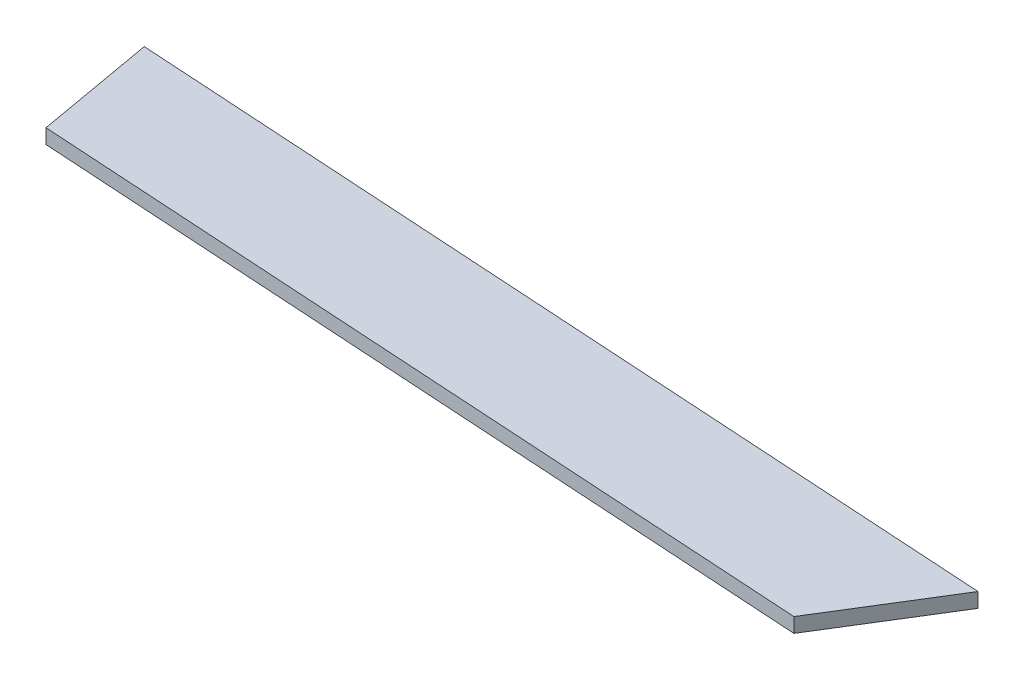
ISO-10303-21;
HEADER;
FILE_DESCRIPTION(('STEP AP214'),'2;1');
FILE_NAME('part.step','',(''),(''),'','','');
FILE_SCHEMA(('AUTOMOTIVE_DESIGN { 1 0 10303 214 1 1 1 1 }'));
ENDSEC;
DATA;
#1=APPLICATION_CONTEXT('core data for automotive mechanical design processes');
#2=APPLICATION_PROTOCOL_DEFINITION('international standard','automotive_design',2000,#1);
#3=PRODUCT_CONTEXT('',#1,'mechanical');
#4=PRODUCT('Part','Part','',(#3));
#5=PRODUCT_RELATED_PRODUCT_CATEGORY('part','',(#4));
#6=PRODUCT_DEFINITION_FORMATION('','',#4);
#7=PRODUCT_DEFINITION_CONTEXT('part definition',#1,'design');
#8=PRODUCT_DEFINITION('design','',#6,#7);
#9=PRODUCT_DEFINITION_SHAPE('','',#8);
#10=(LENGTH_UNIT() NAMED_UNIT(*) SI_UNIT(.MILLI.,.METRE.));
#11=(NAMED_UNIT(*) PLANE_ANGLE_UNIT() SI_UNIT($,.RADIAN.));
#12=(NAMED_UNIT(*) SI_UNIT($,.STERADIAN.) SOLID_ANGLE_UNIT());
#13=UNCERTAINTY_MEASURE_WITH_UNIT(LENGTH_MEASURE(1.E-05),#10,'distance_accuracy_value','');
#14=(GEOMETRIC_REPRESENTATION_CONTEXT(3) GLOBAL_UNCERTAINTY_ASSIGNED_CONTEXT((#13)) GLOBAL_UNIT_ASSIGNED_CONTEXT((#10,
#11,#12)) REPRESENTATION_CONTEXT('',''));
#15=CARTESIAN_POINT('',(0.,0.,0.));
#16=DIRECTION('',(0.,0.,1.));
#17=DIRECTION('',(1.,0.,0.));
#18=AXIS2_PLACEMENT_3D('',#15,#16,#17);
#19=CARTESIAN_POINT('',(0.,2.,0.));
#20=DIRECTION('',(0.0618288058996422,0.,-0.998086769154378));
#21=DIRECTION('',(-0.998086769154378,0.,-0.0618288058996422));
#22=AXIS2_PLACEMENT_3D('',#19,#20,#21);
#23=PLANE('',#22);
#24=DIRECTION('',(0.998086769154378,0.,0.0618288058996422));
#25=VECTOR('',#24,1.);
#26=CARTESIAN_POINT('',(0.,0.,0.));
#27=LINE('',#26,#25);
#28=CARTESIAN_POINT('',(0.,0.,0.));
#29=VERTEX_POINT('',#28);
#30=CARTESIAN_POINT('',(109.181194572617,0.,6.76348299140439));
#31=VERTEX_POINT('',#30);
#32=EDGE_CURVE('E96',#29,#31,#27,.T.);
#33=ORIENTED_EDGE('',*,*,#32,.T.);
#34=DIRECTION('',(0.,-1.,0.));
#35=VECTOR('',#34,1.);
#36=CARTESIAN_POINT('',(109.181194572617,2.,6.76348299140439));
#37=LINE('',#36,#35);
#38=CARTESIAN_POINT('',(109.181194572617,2.,6.76348299140439));
#39=VERTEX_POINT('',#38);
#40=EDGE_CURVE('E11',#39,#31,#37,.T.);
#41=ORIENTED_EDGE('',*,*,#40,.F.);
#42=DIRECTION('',(0.998086769154378,0.,0.0618288058996422));
#43=VECTOR('',#42,1.);
#44=CARTESIAN_POINT('',(0.,2.,0.));
#45=LINE('',#44,#43);
#46=CARTESIAN_POINT('',(0.,2.,0.));
#47=VERTEX_POINT('',#46);
#48=EDGE_CURVE('E84',#47,#39,#45,.T.);
#49=ORIENTED_EDGE('',*,*,#48,.F.);
#50=DIRECTION('',(0.,-1.,0.));
#51=VECTOR('',#50,1.);
#52=CARTESIAN_POINT('',(0.,2.,0.));
#53=LINE('',#52,#51);
#54=EDGE_CURVE('E92',#47,#29,#53,.T.);
#55=ORIENTED_EDGE('',*,*,#54,.T.);
#56=EDGE_LOOP('',(#33,#41,#49,#55));
#57=FACE_BOUND('',#56,.T.);
#58=ADVANCED_FACE('F33',(#57),#23,.F.);
#59=CARTESIAN_POINT('',(109.181194572617,2.,6.76348299140439));
#60=DIRECTION('',(-0.850453149890007,0.,-0.526050795876373));
#61=DIRECTION('',(-0.526050795876373,0.,0.850453149890007));
#62=AXIS2_PLACEMENT_3D('',#59,#60,#61);
#63=PLANE('',#62);
#64=DIRECTION('',(0.526050795876373,0.,-0.850453149890007));
#65=VECTOR('',#64,1.);
#66=CARTESIAN_POINT('',(109.181194572617,0.,6.76348299140439));
#67=LINE('',#66,#65);
#68=CARTESIAN_POINT('',(118.815081062432,0.,-8.81138007347671));
#69=VERTEX_POINT('',#68);
#70=EDGE_CURVE('E88',#31,#69,#67,.T.);
#71=ORIENTED_EDGE('',*,*,#70,.T.);
#72=DIRECTION('',(0.,-1.,0.));
#73=VECTOR('',#72,1.);
#74=CARTESIAN_POINT('',(118.815081062432,2.,-8.81138007347671));
#75=LINE('',#74,#73);
#76=CARTESIAN_POINT('',(118.815081062432,2.,-8.81138007347671));
#77=VERTEX_POINT('',#76);
#78=EDGE_CURVE('E41',#77,#69,#75,.T.);
#79=ORIENTED_EDGE('',*,*,#78,.F.);
#80=DIRECTION('',(0.526050795876373,0.,-0.850453149890007));
#81=VECTOR('',#80,1.);
#82=CARTESIAN_POINT('',(109.181194572617,2.,6.76348299140439));
#83=LINE('',#82,#81);
#84=EDGE_CURVE('E79',#39,#77,#83,.T.);
#85=ORIENTED_EDGE('',*,*,#84,.F.);
#86=ORIENTED_EDGE('',*,*,#40,.T.);
#87=EDGE_LOOP('',(#71,#79,#85,#86));
#88=FACE_BOUND('',#87,.T.);
#89=ADVANCED_FACE('F87',(#88),#63,.F.);
#90=CARTESIAN_POINT('',(118.815081062432,2.,-8.81138007347671));
#91=DIRECTION('',(-0.0618288058996407,0.,0.998086769154378));
#92=DIRECTION('',(0.998086769154378,0.,0.0618288058996407));
#93=AXIS2_PLACEMENT_3D('',#90,#91,#92);
#94=PLANE('',#93);
#95=DIRECTION('',(-0.998086769154378,0.,-0.0618288058996407));
#96=VECTOR('',#95,1.);
#97=CARTESIAN_POINT('',(118.815081062432,0.,-8.81138007347671));
#98=LINE('',#97,#96);
#99=CARTESIAN_POINT('',(-2.89691503137546,0.,-16.3511127046563));
#100=VERTEX_POINT('',#99);
#101=EDGE_CURVE('E66',#69,#100,#98,.T.);
#102=ORIENTED_EDGE('',*,*,#101,.T.);
#103=DIRECTION('',(0.,-1.,0.));
#104=VECTOR('',#103,1.);
#105=CARTESIAN_POINT('',(-2.89691503137546,2.,-16.3511127046563));
#106=LINE('',#105,#104);
#107=CARTESIAN_POINT('',(-2.89691503137546,2.,-16.3511127046563));
#108=VERTEX_POINT('',#107);
#109=EDGE_CURVE('E89',#108,#100,#106,.T.);
#110=ORIENTED_EDGE('',*,*,#109,.F.);
#111=DIRECTION('',(-0.998086769154378,0.,-0.0618288058996407));
#112=VECTOR('',#111,1.);
#113=CARTESIAN_POINT('',(118.815081062432,2.,-8.81138007347671));
#114=LINE('',#113,#112);
#115=EDGE_CURVE('E82',#77,#108,#114,.T.);
#116=ORIENTED_EDGE('',*,*,#115,.F.);
#117=ORIENTED_EDGE('',*,*,#78,.T.);
#118=EDGE_LOOP('',(#102,#110,#116,#117));
#119=FACE_BOUND('',#118,.T.);
#120=ADVANCED_FACE('F90',(#119),#94,.F.);
#121=CARTESIAN_POINT('',(-2.89691503137546,2.,-16.3511127046563));
#122=DIRECTION('',(0.984665589923861,0.,-0.174452503621745));
#123=DIRECTION('',(-0.174452503621745,0.,-0.984665589923861));
#124=AXIS2_PLACEMENT_3D('',#121,#122,#123);
#125=PLANE('',#124);
#126=DIRECTION('',(0.174452503621745,0.,0.984665589923861));
#127=VECTOR('',#126,1.);
#128=CARTESIAN_POINT('',(-2.89691503137546,0.,-16.3511127046563));
#129=LINE('',#128,#127);
#130=EDGE_CURVE('E72',#100,#29,#129,.T.);
#131=ORIENTED_EDGE('',*,*,#130,.T.);
#132=ORIENTED_EDGE('',*,*,#54,.F.);
#133=DIRECTION('',(0.174452503621745,0.,0.984665589923861));
#134=VECTOR('',#133,1.);
#135=CARTESIAN_POINT('',(-2.89691503137546,2.,-16.3511127046563));
#136=LINE('',#135,#134);
#137=EDGE_CURVE('E49',#108,#47,#136,.T.);
#138=ORIENTED_EDGE('',*,*,#137,.F.);
#139=ORIENTED_EDGE('',*,*,#109,.T.);
#140=EDGE_LOOP('',(#131,#132,#138,#139));
#141=FACE_BOUND('',#140,.T.);
#142=ADVANCED_FACE('F103',(#141),#125,.F.);
#143=CARTESIAN_POINT('',(0.,2.,0.));
#144=DIRECTION('',(0.,-1.,0.));
#145=DIRECTION('',(0.,0.,-1.));
#146=AXIS2_PLACEMENT_3D('',#143,#144,#145);
#147=PLANE('',#146);
#148=ORIENTED_EDGE('',*,*,#48,.T.);
#149=ORIENTED_EDGE('',*,*,#84,.T.);
#150=ORIENTED_EDGE('',*,*,#115,.T.);
#151=ORIENTED_EDGE('',*,*,#137,.T.);
#152=EDGE_LOOP('',(#148,#149,#150,#151));
#153=FACE_BOUND('',#152,.T.);
#154=ADVANCED_FACE('F80',(#153),#147,.F.);
#155=CARTESIAN_POINT('',(0.,0.,0.));
#156=DIRECTION('',(0.,-1.,0.));
#157=DIRECTION('',(0.,0.,-1.));
#158=AXIS2_PLACEMENT_3D('',#155,#156,#157);
#159=PLANE('',#158);
#160=ORIENTED_EDGE('',*,*,#32,.F.);
#161=ORIENTED_EDGE('',*,*,#130,.F.);
#162=ORIENTED_EDGE('',*,*,#101,.F.);
#163=ORIENTED_EDGE('',*,*,#70,.F.);
#164=EDGE_LOOP('',(#160,#161,#162,#163));
#165=FACE_BOUND('',#164,.T.);
#166=ADVANCED_FACE('F106',(#165),#159,.T.);
#167=CLOSED_SHELL('',(#58,#89,#120,#142,#154,#166));
#168=MANIFOLD_SOLID_BREP('B2',#167);
#169=ADVANCED_BREP_SHAPE_REPRESENTATION('',(#18,#168),#14);
#170=SHAPE_DEFINITION_REPRESENTATION(#9,#169);
ENDSEC;
END-ISO-10303-21;
